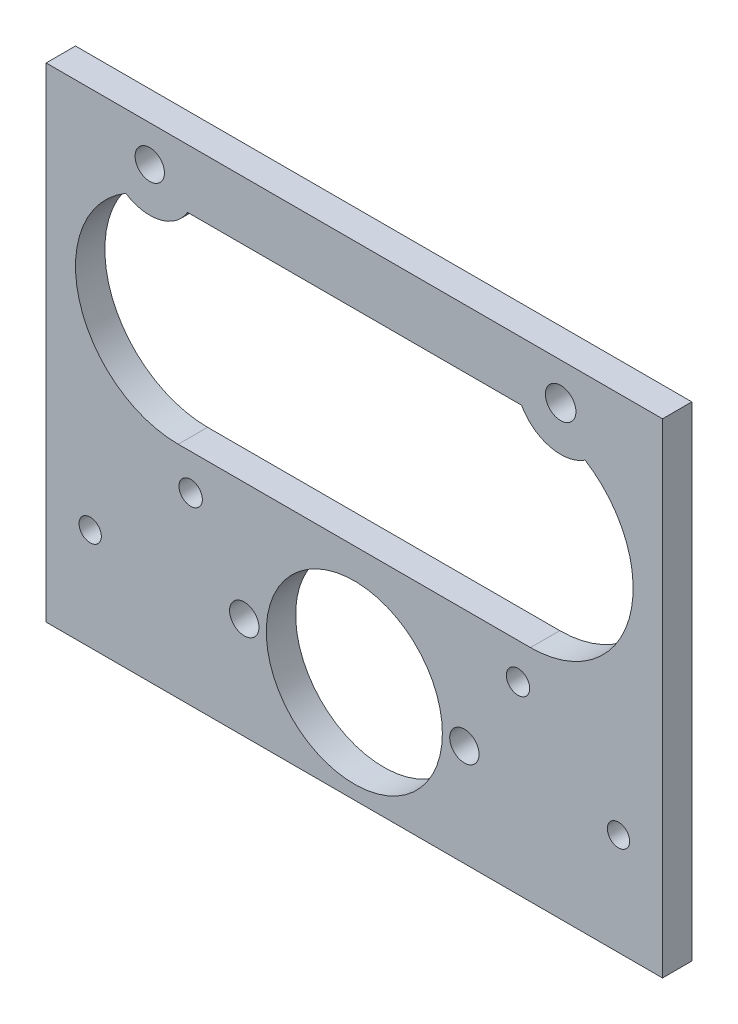
ISO-10303-21;
HEADER;
FILE_DESCRIPTION(('STEP AP214'),'2;1');
FILE_NAME('part.step','',(''),(''),'','','');
FILE_SCHEMA(('AUTOMOTIVE_DESIGN { 1 0 10303 214 1 1 1 1 }'));
ENDSEC;
DATA;
#1=APPLICATION_CONTEXT('core data for automotive mechanical design processes');
#2=APPLICATION_PROTOCOL_DEFINITION('international standard','automotive_design',2000,#1);
#3=PRODUCT_CONTEXT('',#1,'mechanical');
#4=PRODUCT('Part','Part','',(#3));
#5=PRODUCT_RELATED_PRODUCT_CATEGORY('part','',(#4));
#6=PRODUCT_DEFINITION_FORMATION('','',#4);
#7=PRODUCT_DEFINITION_CONTEXT('part definition',#1,'design');
#8=PRODUCT_DEFINITION('design','',#6,#7);
#9=PRODUCT_DEFINITION_SHAPE('','',#8);
#10=(LENGTH_UNIT() NAMED_UNIT(*) SI_UNIT(.MILLI.,.METRE.));
#11=(NAMED_UNIT(*) PLANE_ANGLE_UNIT() SI_UNIT($,.RADIAN.));
#12=(NAMED_UNIT(*) SI_UNIT($,.STERADIAN.) SOLID_ANGLE_UNIT());
#13=UNCERTAINTY_MEASURE_WITH_UNIT(LENGTH_MEASURE(1.E-05),#10,'distance_accuracy_value','');
#14=(GEOMETRIC_REPRESENTATION_CONTEXT(3) GLOBAL_UNCERTAINTY_ASSIGNED_CONTEXT((#13)) GLOBAL_UNIT_ASSIGNED_CONTEXT((#10,
#11,#12)) REPRESENTATION_CONTEXT('',''));
#15=CARTESIAN_POINT('',(0.,0.,0.));
#16=DIRECTION('',(0.,0.,1.));
#17=DIRECTION('',(1.,0.,0.));
#18=AXIS2_PLACEMENT_3D('',#15,#16,#17);
#19=CARTESIAN_POINT('',(-66.675,-22.0345,-6.35));
#20=DIRECTION('',(0.,-1.,0.));
#21=DIRECTION('',(0.,0.,-1.));
#22=AXIS2_PLACEMENT_3D('',#19,#20,#21);
#23=PLANE('',#22);
#24=DIRECTION('',(1.,0.,0.));
#25=VECTOR('',#24,1.);
#26=CARTESIAN_POINT('',(-66.675,-22.0345,0.));
#27=LINE('',#26,#25);
#28=CARTESIAN_POINT('',(-66.675,-22.0345,0.));
#29=VERTEX_POINT('',#28);
#30=CARTESIAN_POINT('',(66.675,-22.0345,0.));
#31=VERTEX_POINT('',#30);
#32=EDGE_CURVE('E175',#29,#31,#27,.T.);
#33=ORIENTED_EDGE('',*,*,#32,.F.);
#34=DIRECTION('',(0.,0.,1.));
#35=VECTOR('',#34,1.);
#36=CARTESIAN_POINT('',(-66.675,-22.0345,-6.35));
#37=LINE('',#36,#35);
#38=CARTESIAN_POINT('',(-66.675,-22.0345,-6.35));
#39=VERTEX_POINT('',#38);
#40=EDGE_CURVE('E11',#39,#29,#37,.T.);
#41=ORIENTED_EDGE('',*,*,#40,.F.);
#42=DIRECTION('',(1.,0.,0.));
#43=VECTOR('',#42,1.);
#44=CARTESIAN_POINT('',(-66.675,-22.0345,-6.35));
#45=LINE('',#44,#43);
#46=CARTESIAN_POINT('',(66.675,-22.0345,-6.35));
#47=VERTEX_POINT('',#46);
#48=EDGE_CURVE('E178',#39,#47,#45,.T.);
#49=ORIENTED_EDGE('',*,*,#48,.T.);
#50=DIRECTION('',(0.,0.,1.));
#51=VECTOR('',#50,1.);
#52=CARTESIAN_POINT('',(66.675,-22.0345,-6.35));
#53=LINE('',#52,#51);
#54=EDGE_CURVE('E35',#47,#31,#53,.T.);
#55=ORIENTED_EDGE('',*,*,#54,.T.);
#56=EDGE_LOOP('',(#33,#41,#49,#55));
#57=FACE_BOUND('',#56,.T.);
#58=ADVANCED_FACE('F32',(#57),#23,.T.);
#59=CARTESIAN_POINT('',(-66.675,82.7405,-6.35));
#60=DIRECTION('',(-1.,0.,0.));
#61=DIRECTION('',(0.,0.,1.));
#62=AXIS2_PLACEMENT_3D('',#59,#60,#61);
#63=PLANE('',#62);
#64=DIRECTION('',(0.,-1.,0.));
#65=VECTOR('',#64,1.);
#66=CARTESIAN_POINT('',(-66.675,82.7405,0.));
#67=LINE('',#66,#65);
#68=CARTESIAN_POINT('',(-66.675,82.7405,0.));
#69=VERTEX_POINT('',#68);
#70=EDGE_CURVE('E182',#69,#29,#67,.T.);
#71=ORIENTED_EDGE('',*,*,#70,.F.);
#72=DIRECTION('',(0.,0.,1.));
#73=VECTOR('',#72,1.);
#74=CARTESIAN_POINT('',(-66.675,82.7405,-6.35));
#75=LINE('',#74,#73);
#76=CARTESIAN_POINT('',(-66.675,82.7405,-6.35));
#77=VERTEX_POINT('',#76);
#78=EDGE_CURVE('E40',#77,#69,#75,.T.);
#79=ORIENTED_EDGE('',*,*,#78,.F.);
#80=DIRECTION('',(0.,-1.,0.));
#81=VECTOR('',#80,1.);
#82=CARTESIAN_POINT('',(-66.675,82.7405,-6.35));
#83=LINE('',#82,#81);
#84=EDGE_CURVE('E188',#77,#39,#83,.T.);
#85=ORIENTED_EDGE('',*,*,#84,.T.);
#86=ORIENTED_EDGE('',*,*,#40,.T.);
#87=EDGE_LOOP('',(#71,#79,#85,#86));
#88=FACE_BOUND('',#87,.T.);
#89=ADVANCED_FACE('F214',(#88),#63,.T.);
#90=CARTESIAN_POINT('',(-66.675,82.7405,-6.35));
#91=DIRECTION('',(0.,1.,0.));
#92=DIRECTION('',(0.,0.,1.));
#93=AXIS2_PLACEMENT_3D('',#90,#91,#92);
#94=PLANE('',#93);
#95=DIRECTION('',(-1.,0.,0.));
#96=VECTOR('',#95,1.);
#97=CARTESIAN_POINT('',(-66.675,82.7405,0.));
#98=LINE('',#97,#96);
#99=CARTESIAN_POINT('',(66.675,82.7405,0.));
#100=VERTEX_POINT('',#99);
#101=EDGE_CURVE('E196',#100,#69,#98,.T.);
#102=ORIENTED_EDGE('',*,*,#101,.F.);
#103=DIRECTION('',(0.,0.,1.));
#104=VECTOR('',#103,1.);
#105=CARTESIAN_POINT('',(66.675,82.7405,-6.35));
#106=LINE('',#105,#104);
#107=CARTESIAN_POINT('',(66.675,82.7405,-6.35));
#108=VERTEX_POINT('',#107);
#109=EDGE_CURVE('E201',#108,#100,#106,.T.);
#110=ORIENTED_EDGE('',*,*,#109,.F.);
#111=DIRECTION('',(-1.,0.,0.));
#112=VECTOR('',#111,1.);
#113=CARTESIAN_POINT('',(-66.675,82.7405,-6.35));
#114=LINE('',#113,#112);
#115=EDGE_CURVE('E185',#108,#77,#114,.T.);
#116=ORIENTED_EDGE('',*,*,#115,.T.);
#117=ORIENTED_EDGE('',*,*,#78,.T.);
#118=EDGE_LOOP('',(#102,#110,#116,#117));
#119=FACE_BOUND('',#118,.T.);
#120=ADVANCED_FACE('F219',(#119),#94,.T.);
#121=CARTESIAN_POINT('',(66.675,-22.0345,-6.35));
#122=DIRECTION('',(1.,0.,0.));
#123=DIRECTION('',(0.,0.,-1.));
#124=AXIS2_PLACEMENT_3D('',#121,#122,#123);
#125=PLANE('',#124);
#126=DIRECTION('',(0.,1.,0.));
#127=VECTOR('',#126,1.);
#128=CARTESIAN_POINT('',(66.675,-22.0345,0.));
#129=LINE('',#128,#127);
#130=EDGE_CURVE('E193',#31,#100,#129,.T.);
#131=ORIENTED_EDGE('',*,*,#130,.F.);
#132=ORIENTED_EDGE('',*,*,#54,.F.);
#133=DIRECTION('',(0.,1.,0.));
#134=VECTOR('',#133,1.);
#135=CARTESIAN_POINT('',(66.675,-22.0345,-6.35));
#136=LINE('',#135,#134);
#137=EDGE_CURVE('E181',#47,#108,#136,.T.);
#138=ORIENTED_EDGE('',*,*,#137,.T.);
#139=ORIENTED_EDGE('',*,*,#109,.T.);
#140=EDGE_LOOP('',(#131,#132,#138,#139));
#141=FACE_BOUND('',#140,.T.);
#142=ADVANCED_FACE('F209',(#141),#125,.T.);
#143=CARTESIAN_POINT('',(0.,0.,-6.35));
#144=DIRECTION('',(0.,0.,1.));
#145=DIRECTION('',(1.,0.,0.));
#146=AXIS2_PLACEMENT_3D('',#143,#144,#145);
#147=PLANE('',#146);
#148=CARTESIAN_POINT('',(57.1499999999999,-1.07552855510562E-13,-6.35));
#149=DIRECTION('',(0.,0.,1.));
#150=DIRECTION('',(1.,0.,0.));
#151=AXIS2_PLACEMENT_3D('',#148,#149,#150);
#152=CIRCLE('',#151,2.41299999999997);
#153=CARTESIAN_POINT('',(59.5629999999998,-1.07552855510562E-13,-6.35));
#154=VERTEX_POINT('',#153);
#155=EDGE_CURVE('E414',#154,#154,#152,.T.);
#156=ORIENTED_EDGE('',*,*,#155,.T.);
#157=EDGE_LOOP('',(#156));
#158=FACE_BOUND('',#157,.T.);
#159=CARTESIAN_POINT('',(35.4115067199124,17.8307999999999,-6.35));
#160=DIRECTION('',(0.,0.,1.));
#161=DIRECTION('',(1.,0.,0.));
#162=AXIS2_PLACEMENT_3D('',#159,#160,#161);
#163=CIRCLE('',#162,2.52729999999989);
#164=CARTESIAN_POINT('',(37.9388067199123,17.8307999999999,-6.35));
#165=VERTEX_POINT('',#164);
#166=EDGE_CURVE('E422',#165,#165,#163,.T.);
#167=ORIENTED_EDGE('',*,*,#166,.T.);
#168=EDGE_LOOP('',(#167));
#169=FACE_BOUND('',#168,.T.);
#170=CARTESIAN_POINT('',(23.8125,0.,-6.35));
#171=DIRECTION('',(0.,0.,1.));
#172=DIRECTION('',(1.,0.,0.));
#173=AXIS2_PLACEMENT_3D('',#170,#171,#172);
#174=CIRCLE('',#173,3.17499999999995);
#175=CARTESIAN_POINT('',(26.9874999999999,0.,-6.35));
#176=VERTEX_POINT('',#175);
#177=EDGE_CURVE('E428',#176,#176,#174,.T.);
#178=ORIENTED_EDGE('',*,*,#177,.T.);
#179=EDGE_LOOP('',(#178));
#180=FACE_BOUND('',#179,.T.);
#181=CARTESIAN_POINT('',(0.,0.,-6.35));
#182=DIRECTION('',(0.,0.,1.));
#183=DIRECTION('',(1.,0.,0.));
#184=AXIS2_PLACEMENT_3D('',#181,#182,#183);
#185=CIRCLE('',#184,19.05);
#186=CARTESIAN_POINT('',(19.0499999999999,0.,-6.35));
#187=VERTEX_POINT('',#186);
#188=EDGE_CURVE('E434',#187,#187,#185,.T.);
#189=ORIENTED_EDGE('',*,*,#188,.T.);
#190=EDGE_LOOP('',(#189));
#191=FACE_BOUND('',#190,.T.);
#192=CARTESIAN_POINT('',(-23.8125,0.,-6.35));
#193=DIRECTION('',(0.,0.,1.));
#194=DIRECTION('',(1.,0.,0.));
#195=AXIS2_PLACEMENT_3D('',#192,#193,#194);
#196=CIRCLE('',#195,3.17499999999995);
#197=CARTESIAN_POINT('',(-20.6375000000001,0.,-6.35));
#198=VERTEX_POINT('',#197);
#199=EDGE_CURVE('E440',#198,#198,#196,.T.);
#200=ORIENTED_EDGE('',*,*,#199,.T.);
#201=EDGE_LOOP('',(#200));
#202=FACE_BOUND('',#201,.T.);
#203=CARTESIAN_POINT('',(-35.4115067199124,17.8308,-6.35));
#204=DIRECTION('',(0.,0.,1.));
#205=DIRECTION('',(1.,0.,0.));
#206=AXIS2_PLACEMENT_3D('',#203,#204,#205);
#207=CIRCLE('',#206,2.52729999999993);
#208=CARTESIAN_POINT('',(-32.8842067199124,17.8308,-6.35));
#209=VERTEX_POINT('',#208);
#210=EDGE_CURVE('E446',#209,#209,#207,.T.);
#211=ORIENTED_EDGE('',*,*,#210,.T.);
#212=EDGE_LOOP('',(#211));
#213=FACE_BOUND('',#212,.T.);
#214=CARTESIAN_POINT('',(-57.1500000000001,0.,-6.35));
#215=DIRECTION('',(0.,0.,1.));
#216=DIRECTION('',(1.,0.,0.));
#217=AXIS2_PLACEMENT_3D('',#214,#215,#216);
#218=CIRCLE('',#217,2.41299999999997);
#219=CARTESIAN_POINT('',(-54.7370000000001,0.,-6.35));
#220=VERTEX_POINT('',#219);
#221=EDGE_CURVE('E146',#220,#220,#218,.T.);
#222=ORIENTED_EDGE('',*,*,#221,.T.);
#223=EDGE_LOOP('',(#222));
#224=FACE_BOUND('',#223,.T.);
#225=CARTESIAN_POINT('',(-44.2581816086823,74.9211107919667,-6.35));
#226=DIRECTION('',(0.,0.,-1.));
#227=DIRECTION('',(1.,0.,0.));
#228=AXIS2_PLACEMENT_3D('',#225,#226,#227);
#229=CIRCLE('',#228,9.525);
#230=CARTESIAN_POINT('',(-36.0786178490837,70.0405,-6.35));
#231=VERTEX_POINT('',#230);
#232=CARTESIAN_POINT('',(-49.4406415663801,66.9293817057889,-6.35));
#233=VERTEX_POINT('',#232);
#234=EDGE_CURVE('E117',#231,#233,#229,.T.);
#235=ORIENTED_EDGE('',*,*,#234,.T.);
#236=CARTESIAN_POINT('',(-38.1,47.8155,-6.35));
#237=DIRECTION('',(0.,0.,1.));
#238=DIRECTION('',(1.,0.,0.));
#239=AXIS2_PLACEMENT_3D('',#236,#237,#238);
#240=CIRCLE('',#239,22.225);
#241=CARTESIAN_POINT('',(-38.1,25.5905,-6.35));
#242=VERTEX_POINT('',#241);
#243=EDGE_CURVE('E111',#233,#242,#240,.T.);
#244=ORIENTED_EDGE('',*,*,#243,.T.);
#245=DIRECTION('',(1.,0.,0.));
#246=VECTOR('',#245,1.);
#247=CARTESIAN_POINT('',(-38.1,25.5905,-6.35));
#248=LINE('',#247,#246);
#249=CARTESIAN_POINT('',(38.1,25.5905,-6.35));
#250=VERTEX_POINT('',#249);
#251=EDGE_CURVE('E120',#242,#250,#248,.T.);
#252=ORIENTED_EDGE('',*,*,#251,.T.);
#253=CARTESIAN_POINT('',(38.1,47.8155,-6.35));
#254=DIRECTION('',(0.,0.,1.));
#255=DIRECTION('',(1.,0.,0.));
#256=AXIS2_PLACEMENT_3D('',#253,#254,#255);
#257=CIRCLE('',#256,22.225);
#258=CARTESIAN_POINT('',(49.9388189514144,66.624885711278,-6.35));
#259=VERTEX_POINT('',#258);
#260=EDGE_CURVE('E48',#250,#259,#257,.T.);
#261=ORIENTED_EDGE('',*,*,#260,.T.);
#262=CARTESIAN_POINT('',(44.641526579993,74.6933302659416,-6.35));
#263=DIRECTION('',(0.,0.,-1.));
#264=DIRECTION('',(1.,0.,0.));
#265=AXIS2_PLACEMENT_3D('',#262,#263,#264);
#266=CIRCLE('',#265,9.65199999999999);
#267=CARTESIAN_POINT('',(36.18503354113,70.0405,-6.35));
#268=VERTEX_POINT('',#267);
#269=EDGE_CURVE('E138',#259,#268,#266,.T.);
#270=ORIENTED_EDGE('',*,*,#269,.T.);
#271=DIRECTION('',(-1.,0.,0.));
#272=VECTOR('',#271,1.);
#273=CARTESIAN_POINT('',(-36.0786178490837,70.0405,-6.35));
#274=LINE('',#273,#272);
#275=EDGE_CURVE('E141',#268,#231,#274,.T.);
#276=ORIENTED_EDGE('',*,*,#275,.T.);
#277=EDGE_LOOP('',(#235,#244,#252,#261,#270,#276));
#278=FACE_BOUND('',#277,.T.);
#279=CARTESIAN_POINT('',(-44.2581816086823,74.9211107919667,-6.35));
#280=DIRECTION('',(0.,0.,1.));
#281=DIRECTION('',(1.,0.,0.));
#282=AXIS2_PLACEMENT_3D('',#279,#280,#281);
#283=CIRCLE('',#282,3.175);
#284=CARTESIAN_POINT('',(-41.0831816086823,74.9211107919667,-6.35));
#285=VERTEX_POINT('',#284);
#286=EDGE_CURVE('E166',#285,#285,#283,.T.);
#287=ORIENTED_EDGE('',*,*,#286,.T.);
#288=EDGE_LOOP('',(#287));
#289=FACE_BOUND('',#288,.T.);
#290=CARTESIAN_POINT('',(44.641526579993,74.6933302659416,-6.35));
#291=DIRECTION('',(0.,0.,1.));
#292=DIRECTION('',(1.,0.,0.));
#293=AXIS2_PLACEMENT_3D('',#290,#291,#292);
#294=CIRCLE('',#293,3.30199999999999);
#295=CARTESIAN_POINT('',(47.943526579993,74.6933302659416,-6.35));
#296=VERTEX_POINT('',#295);
#297=EDGE_CURVE('E172',#296,#296,#294,.T.);
#298=ORIENTED_EDGE('',*,*,#297,.T.);
#299=EDGE_LOOP('',(#298));
#300=FACE_BOUND('',#299,.T.);
#301=ORIENTED_EDGE('',*,*,#48,.F.);
#302=ORIENTED_EDGE('',*,*,#84,.F.);
#303=ORIENTED_EDGE('',*,*,#115,.F.);
#304=ORIENTED_EDGE('',*,*,#137,.F.);
#305=EDGE_LOOP('',(#301,#302,#303,#304));
#306=FACE_BOUND('',#305,.T.);
#307=ADVANCED_FACE('F124',(#158,#169,#180,#191,#202,#213,#224,#278,#289,#300,#306),#147,.F.);
#308=CARTESIAN_POINT('',(0.,0.,0.));
#309=DIRECTION('',(0.,0.,1.));
#310=DIRECTION('',(1.,0.,0.));
#311=AXIS2_PLACEMENT_3D('',#308,#309,#310);
#312=PLANE('',#311);
#313=CARTESIAN_POINT('',(57.1499999999999,-1.07552855510562E-13,0.));
#314=DIRECTION('',(0.,0.,1.));
#315=DIRECTION('',(1.,0.,0.));
#316=AXIS2_PLACEMENT_3D('',#313,#314,#315);
#317=CIRCLE('',#316,2.41299999999997);
#318=CARTESIAN_POINT('',(59.5629999999998,-1.07552855510562E-13,0.));
#319=VERTEX_POINT('',#318);
#320=EDGE_CURVE('E417',#319,#319,#317,.T.);
#321=ORIENTED_EDGE('',*,*,#320,.F.);
#322=EDGE_LOOP('',(#321));
#323=FACE_BOUND('',#322,.T.);
#324=CARTESIAN_POINT('',(35.4115067199124,17.8307999999999,0.));
#325=DIRECTION('',(0.,0.,1.));
#326=DIRECTION('',(1.,0.,0.));
#327=AXIS2_PLACEMENT_3D('',#324,#325,#326);
#328=CIRCLE('',#327,2.52729999999989);
#329=CARTESIAN_POINT('',(37.9388067199123,17.8307999999999,0.));
#330=VERTEX_POINT('',#329);
#331=EDGE_CURVE('E419',#330,#330,#328,.T.);
#332=ORIENTED_EDGE('',*,*,#331,.F.);
#333=EDGE_LOOP('',(#332));
#334=FACE_BOUND('',#333,.T.);
#335=CARTESIAN_POINT('',(23.8125,0.,0.));
#336=DIRECTION('',(0.,0.,1.));
#337=DIRECTION('',(1.,0.,0.));
#338=AXIS2_PLACEMENT_3D('',#335,#336,#337);
#339=CIRCLE('',#338,3.17499999999995);
#340=CARTESIAN_POINT('',(26.9874999999999,0.,0.));
#341=VERTEX_POINT('',#340);
#342=EDGE_CURVE('E425',#341,#341,#339,.T.);
#343=ORIENTED_EDGE('',*,*,#342,.F.);
#344=EDGE_LOOP('',(#343));
#345=FACE_BOUND('',#344,.T.);
#346=CARTESIAN_POINT('',(0.,0.,0.));
#347=DIRECTION('',(0.,0.,1.));
#348=DIRECTION('',(1.,0.,0.));
#349=AXIS2_PLACEMENT_3D('',#346,#347,#348);
#350=CIRCLE('',#349,19.05);
#351=CARTESIAN_POINT('',(19.0499999999999,0.,0.));
#352=VERTEX_POINT('',#351);
#353=EDGE_CURVE('E431',#352,#352,#350,.T.);
#354=ORIENTED_EDGE('',*,*,#353,.F.);
#355=EDGE_LOOP('',(#354));
#356=FACE_BOUND('',#355,.T.);
#357=CARTESIAN_POINT('',(-23.8125,0.,0.));
#358=DIRECTION('',(0.,0.,1.));
#359=DIRECTION('',(1.,0.,0.));
#360=AXIS2_PLACEMENT_3D('',#357,#358,#359);
#361=CIRCLE('',#360,3.17499999999995);
#362=CARTESIAN_POINT('',(-20.6375000000001,0.,0.));
#363=VERTEX_POINT('',#362);
#364=EDGE_CURVE('E437',#363,#363,#361,.T.);
#365=ORIENTED_EDGE('',*,*,#364,.F.);
#366=EDGE_LOOP('',(#365));
#367=FACE_BOUND('',#366,.T.);
#368=CARTESIAN_POINT('',(-35.4115067199124,17.8308,0.));
#369=DIRECTION('',(0.,0.,1.));
#370=DIRECTION('',(1.,0.,0.));
#371=AXIS2_PLACEMENT_3D('',#368,#369,#370);
#372=CIRCLE('',#371,2.52729999999993);
#373=CARTESIAN_POINT('',(-32.8842067199124,17.8308,0.));
#374=VERTEX_POINT('',#373);
#375=EDGE_CURVE('E443',#374,#374,#372,.T.);
#376=ORIENTED_EDGE('',*,*,#375,.F.);
#377=EDGE_LOOP('',(#376));
#378=FACE_BOUND('',#377,.T.);
#379=CARTESIAN_POINT('',(-57.1500000000001,0.,0.));
#380=DIRECTION('',(0.,0.,1.));
#381=DIRECTION('',(1.,0.,0.));
#382=AXIS2_PLACEMENT_3D('',#379,#380,#381);
#383=CIRCLE('',#382,2.41299999999997);
#384=CARTESIAN_POINT('',(-54.7370000000001,0.,0.));
#385=VERTEX_POINT('',#384);
#386=EDGE_CURVE('E134',#385,#385,#383,.T.);
#387=ORIENTED_EDGE('',*,*,#386,.F.);
#388=EDGE_LOOP('',(#387));
#389=FACE_BOUND('',#388,.T.);
#390=CARTESIAN_POINT('',(-38.1,47.8155,0.));
#391=DIRECTION('',(0.,0.,1.));
#392=DIRECTION('',(1.,0.,0.));
#393=AXIS2_PLACEMENT_3D('',#390,#391,#392);
#394=CIRCLE('',#393,22.225);
#395=CARTESIAN_POINT('',(-49.4406415663801,66.9293817057889,0.));
#396=VERTEX_POINT('',#395);
#397=CARTESIAN_POINT('',(-38.1,25.5905,0.));
#398=VERTEX_POINT('',#397);
#399=EDGE_CURVE('E56',#396,#398,#394,.T.);
#400=ORIENTED_EDGE('',*,*,#399,.F.);
#401=CARTESIAN_POINT('',(-44.2581816086823,74.9211107919667,0.));
#402=DIRECTION('',(0.,0.,-1.));
#403=DIRECTION('',(1.,0.,0.));
#404=AXIS2_PLACEMENT_3D('',#401,#402,#403);
#405=CIRCLE('',#404,9.525);
#406=CARTESIAN_POINT('',(-36.0786178490837,70.0405,0.));
#407=VERTEX_POINT('',#406);
#408=EDGE_CURVE('E128',#407,#396,#405,.T.);
#409=ORIENTED_EDGE('',*,*,#408,.F.);
#410=DIRECTION('',(-1.,0.,0.));
#411=VECTOR('',#410,1.);
#412=CARTESIAN_POINT('',(-36.0786178490837,70.0405,0.));
#413=LINE('',#412,#411);
#414=CARTESIAN_POINT('',(36.18503354113,70.0405,0.));
#415=VERTEX_POINT('',#414);
#416=EDGE_CURVE('E131',#415,#407,#413,.T.);
#417=ORIENTED_EDGE('',*,*,#416,.F.);
#418=CARTESIAN_POINT('',(44.641526579993,74.6933302659416,0.));
#419=DIRECTION('',(0.,0.,-1.));
#420=DIRECTION('',(1.,0.,0.));
#421=AXIS2_PLACEMENT_3D('',#418,#419,#420);
#422=CIRCLE('',#421,9.65199999999999);
#423=CARTESIAN_POINT('',(49.9388189514144,66.624885711278,0.));
#424=VERTEX_POINT('',#423);
#425=EDGE_CURVE('E151',#424,#415,#422,.T.);
#426=ORIENTED_EDGE('',*,*,#425,.F.);
#427=CARTESIAN_POINT('',(38.1,47.8155,0.));
#428=DIRECTION('',(0.,0.,1.));
#429=DIRECTION('',(1.,0.,0.));
#430=AXIS2_PLACEMENT_3D('',#427,#428,#429);
#431=CIRCLE('',#430,22.225);
#432=CARTESIAN_POINT('',(38.1,25.5905,0.));
#433=VERTEX_POINT('',#432);
#434=EDGE_CURVE('E148',#433,#424,#431,.T.);
#435=ORIENTED_EDGE('',*,*,#434,.F.);
#436=DIRECTION('',(1.,0.,0.));
#437=VECTOR('',#436,1.);
#438=CARTESIAN_POINT('',(-38.1,25.5905,0.));
#439=LINE('',#438,#437);
#440=EDGE_CURVE('E145',#398,#433,#439,.T.);
#441=ORIENTED_EDGE('',*,*,#440,.F.);
#442=EDGE_LOOP('',(#400,#409,#417,#426,#435,#441));
#443=FACE_BOUND('',#442,.T.);
#444=CARTESIAN_POINT('',(-44.2581816086823,74.9211107919667,0.));
#445=DIRECTION('',(0.,0.,1.));
#446=DIRECTION('',(1.,0.,0.));
#447=AXIS2_PLACEMENT_3D('',#444,#445,#446);
#448=CIRCLE('',#447,3.175);
#449=CARTESIAN_POINT('',(-41.0831816086823,74.9211107919667,0.));
#450=VERTEX_POINT('',#449);
#451=EDGE_CURVE('E158',#450,#450,#448,.T.);
#452=ORIENTED_EDGE('',*,*,#451,.F.);
#453=EDGE_LOOP('',(#452));
#454=FACE_BOUND('',#453,.T.);
#455=CARTESIAN_POINT('',(44.641526579993,74.6933302659416,0.));
#456=DIRECTION('',(0.,0.,1.));
#457=DIRECTION('',(1.,0.,0.));
#458=AXIS2_PLACEMENT_3D('',#455,#456,#457);
#459=CIRCLE('',#458,3.30199999999999);
#460=CARTESIAN_POINT('',(47.943526579993,74.6933302659416,0.));
#461=VERTEX_POINT('',#460);
#462=EDGE_CURVE('E169',#461,#461,#459,.T.);
#463=ORIENTED_EDGE('',*,*,#462,.F.);
#464=EDGE_LOOP('',(#463));
#465=FACE_BOUND('',#464,.T.);
#466=ORIENTED_EDGE('',*,*,#32,.T.);
#467=ORIENTED_EDGE('',*,*,#130,.T.);
#468=ORIENTED_EDGE('',*,*,#101,.T.);
#469=ORIENTED_EDGE('',*,*,#70,.T.);
#470=EDGE_LOOP('',(#466,#467,#468,#469));
#471=FACE_BOUND('',#470,.T.);
#472=ADVANCED_FACE('F211',(#323,#334,#345,#356,#367,#378,#389,#443,#454,#465,#471),#312,.T.);
#473=CARTESIAN_POINT('',(44.641526579993,74.6933302659416,-6.35));
#474=DIRECTION('',(0.,0.,1.));
#475=DIRECTION('',(1.,0.,0.));
#476=AXIS2_PLACEMENT_3D('',#473,#474,#475);
#477=CYLINDRICAL_SURFACE('',#476,3.30199999999999);
#478=ORIENTED_EDGE('',*,*,#297,.F.);
#479=EDGE_LOOP('',(#478));
#480=FACE_BOUND('',#479,.T.);
#481=ORIENTED_EDGE('',*,*,#462,.T.);
#482=EDGE_LOOP('',(#481));
#483=FACE_BOUND('',#482,.T.);
#484=ADVANCED_FACE('F262',(#480,#483),#477,.F.);
#485=CARTESIAN_POINT('',(-44.2581816086823,74.9211107919667,-6.35));
#486=DIRECTION('',(0.,0.,1.));
#487=DIRECTION('',(1.,0.,0.));
#488=AXIS2_PLACEMENT_3D('',#485,#486,#487);
#489=CYLINDRICAL_SURFACE('',#488,3.175);
#490=ORIENTED_EDGE('',*,*,#286,.F.);
#491=EDGE_LOOP('',(#490));
#492=FACE_BOUND('',#491,.T.);
#493=ORIENTED_EDGE('',*,*,#451,.T.);
#494=EDGE_LOOP('',(#493));
#495=FACE_BOUND('',#494,.T.);
#496=ADVANCED_FACE('F272',(#492,#495),#489,.F.);
#497=CARTESIAN_POINT('',(-38.1,47.8155,-6.35));
#498=DIRECTION('',(0.,0.,1.));
#499=DIRECTION('',(1.,0.,0.));
#500=AXIS2_PLACEMENT_3D('',#497,#498,#499);
#501=CYLINDRICAL_SURFACE('',#500,22.225);
#502=ORIENTED_EDGE('',*,*,#399,.T.);
#503=DIRECTION('',(0.,0.,1.));
#504=VECTOR('',#503,1.);
#505=CARTESIAN_POINT('',(-38.1,25.5905,-6.35));
#506=LINE('',#505,#504);
#507=EDGE_CURVE('E107',#242,#398,#506,.T.);
#508=ORIENTED_EDGE('',*,*,#507,.F.);
#509=ORIENTED_EDGE('',*,*,#243,.F.);
#510=DIRECTION('',(0.,0.,1.));
#511=VECTOR('',#510,1.);
#512=CARTESIAN_POINT('',(-49.4406415663801,66.9293817057889,-6.35));
#513=LINE('',#512,#511);
#514=EDGE_CURVE('E156',#233,#396,#513,.T.);
#515=ORIENTED_EDGE('',*,*,#514,.T.);
#516=EDGE_LOOP('',(#502,#508,#509,#515));
#517=FACE_BOUND('',#516,.T.);
#518=ADVANCED_FACE('F109',(#517),#501,.F.);
#519=CARTESIAN_POINT('',(-44.2581816086823,74.9211107919667,-6.35));
#520=DIRECTION('',(0.,0.,1.));
#521=DIRECTION('',(1.,0.,0.));
#522=AXIS2_PLACEMENT_3D('',#519,#520,#521);
#523=CYLINDRICAL_SURFACE('',#522,9.525);
#524=ORIENTED_EDGE('',*,*,#408,.T.);
#525=ORIENTED_EDGE('',*,*,#514,.F.);
#526=ORIENTED_EDGE('',*,*,#234,.F.);
#527=DIRECTION('',(0.,0.,1.));
#528=VECTOR('',#527,1.);
#529=CARTESIAN_POINT('',(-36.0786178490837,70.0405,-6.35));
#530=LINE('',#529,#528);
#531=EDGE_CURVE('E159',#231,#407,#530,.T.);
#532=ORIENTED_EDGE('',*,*,#531,.T.);
#533=EDGE_LOOP('',(#524,#525,#526,#532));
#534=FACE_BOUND('',#533,.T.);
#535=ADVANCED_FACE('F291',(#534),#523,.T.);
#536=CARTESIAN_POINT('',(-36.0786178490837,70.0405,-6.35));
#537=DIRECTION('',(0.,1.,0.));
#538=DIRECTION('',(0.,0.,1.));
#539=AXIS2_PLACEMENT_3D('',#536,#537,#538);
#540=PLANE('',#539);
#541=ORIENTED_EDGE('',*,*,#416,.T.);
#542=ORIENTED_EDGE('',*,*,#531,.F.);
#543=ORIENTED_EDGE('',*,*,#275,.F.);
#544=DIRECTION('',(0.,0.,1.));
#545=VECTOR('',#544,1.);
#546=CARTESIAN_POINT('',(36.18503354113,70.0405,-6.35));
#547=LINE('',#546,#545);
#548=EDGE_CURVE('E161',#268,#415,#547,.T.);
#549=ORIENTED_EDGE('',*,*,#548,.T.);
#550=EDGE_LOOP('',(#541,#542,#543,#549));
#551=FACE_BOUND('',#550,.T.);
#552=ADVANCED_FACE('F300',(#551),#540,.F.);
#553=CARTESIAN_POINT('',(44.641526579993,74.6933302659416,-6.35));
#554=DIRECTION('',(0.,0.,1.));
#555=DIRECTION('',(1.,0.,0.));
#556=AXIS2_PLACEMENT_3D('',#553,#554,#555);
#557=CYLINDRICAL_SURFACE('',#556,9.65199999999999);
#558=ORIENTED_EDGE('',*,*,#425,.T.);
#559=ORIENTED_EDGE('',*,*,#548,.F.);
#560=ORIENTED_EDGE('',*,*,#269,.F.);
#561=DIRECTION('',(0.,0.,1.));
#562=VECTOR('',#561,1.);
#563=CARTESIAN_POINT('',(49.9388189514144,66.624885711278,-6.35));
#564=LINE('',#563,#562);
#565=EDGE_CURVE('E163',#259,#424,#564,.T.);
#566=ORIENTED_EDGE('',*,*,#565,.T.);
#567=EDGE_LOOP('',(#558,#559,#560,#566));
#568=FACE_BOUND('',#567,.T.);
#569=ADVANCED_FACE('F310',(#568),#557,.T.);
#570=CARTESIAN_POINT('',(38.1,47.8155,-6.35));
#571=DIRECTION('',(0.,0.,1.));
#572=DIRECTION('',(1.,0.,0.));
#573=AXIS2_PLACEMENT_3D('',#570,#571,#572);
#574=CYLINDRICAL_SURFACE('',#573,22.225);
#575=ORIENTED_EDGE('',*,*,#434,.T.);
#576=ORIENTED_EDGE('',*,*,#565,.F.);
#577=ORIENTED_EDGE('',*,*,#260,.F.);
#578=DIRECTION('',(0.,0.,1.));
#579=VECTOR('',#578,1.);
#580=CARTESIAN_POINT('',(38.1,25.5905,-6.35));
#581=LINE('',#580,#579);
#582=EDGE_CURVE('E116',#250,#433,#581,.T.);
#583=ORIENTED_EDGE('',*,*,#582,.T.);
#584=EDGE_LOOP('',(#575,#576,#577,#583));
#585=FACE_BOUND('',#584,.T.);
#586=ADVANCED_FACE('F320',(#585),#574,.F.);
#587=CARTESIAN_POINT('',(-38.1,25.5905,-6.35));
#588=DIRECTION('',(0.,-1.,0.));
#589=DIRECTION('',(0.,0.,-1.));
#590=AXIS2_PLACEMENT_3D('',#587,#588,#589);
#591=PLANE('',#590);
#592=ORIENTED_EDGE('',*,*,#440,.T.);
#593=ORIENTED_EDGE('',*,*,#582,.F.);
#594=ORIENTED_EDGE('',*,*,#251,.F.);
#595=ORIENTED_EDGE('',*,*,#507,.T.);
#596=EDGE_LOOP('',(#592,#593,#594,#595));
#597=FACE_BOUND('',#596,.T.);
#598=ADVANCED_FACE('F121',(#597),#591,.F.);
#599=CARTESIAN_POINT('',(-57.1500000000001,0.,-6.35));
#600=DIRECTION('',(0.,0.,1.));
#601=DIRECTION('',(1.,0.,0.));
#602=AXIS2_PLACEMENT_3D('',#599,#600,#601);
#603=CYLINDRICAL_SURFACE('',#602,2.41299999999997);
#604=ORIENTED_EDGE('',*,*,#221,.F.);
#605=EDGE_LOOP('',(#604));
#606=FACE_BOUND('',#605,.T.);
#607=ORIENTED_EDGE('',*,*,#386,.T.);
#608=EDGE_LOOP('',(#607));
#609=FACE_BOUND('',#608,.T.);
#610=ADVANCED_FACE('F338',(#606,#609),#603,.F.);
#611=CARTESIAN_POINT('',(-35.4115067199124,17.8308,-6.35));
#612=DIRECTION('',(0.,0.,1.));
#613=DIRECTION('',(1.,0.,0.));
#614=AXIS2_PLACEMENT_3D('',#611,#612,#613);
#615=CYLINDRICAL_SURFACE('',#614,2.52729999999993);
#616=ORIENTED_EDGE('',*,*,#210,.F.);
#617=EDGE_LOOP('',(#616));
#618=FACE_BOUND('',#617,.T.);
#619=ORIENTED_EDGE('',*,*,#375,.T.);
#620=EDGE_LOOP('',(#619));
#621=FACE_BOUND('',#620,.T.);
#622=ADVANCED_FACE('F347',(#618,#621),#615,.F.);
#623=CARTESIAN_POINT('',(-23.8125,0.,-6.35));
#624=DIRECTION('',(0.,0.,1.));
#625=DIRECTION('',(1.,0.,0.));
#626=AXIS2_PLACEMENT_3D('',#623,#624,#625);
#627=CYLINDRICAL_SURFACE('',#626,3.17499999999995);
#628=ORIENTED_EDGE('',*,*,#199,.F.);
#629=EDGE_LOOP('',(#628));
#630=FACE_BOUND('',#629,.T.);
#631=ORIENTED_EDGE('',*,*,#364,.T.);
#632=EDGE_LOOP('',(#631));
#633=FACE_BOUND('',#632,.T.);
#634=ADVANCED_FACE('F357',(#630,#633),#627,.F.);
#635=CARTESIAN_POINT('',(0.,0.,-6.35));
#636=DIRECTION('',(0.,0.,1.));
#637=DIRECTION('',(1.,0.,0.));
#638=AXIS2_PLACEMENT_3D('',#635,#636,#637);
#639=CYLINDRICAL_SURFACE('',#638,19.05);
#640=ORIENTED_EDGE('',*,*,#188,.F.);
#641=EDGE_LOOP('',(#640));
#642=FACE_BOUND('',#641,.T.);
#643=ORIENTED_EDGE('',*,*,#353,.T.);
#644=EDGE_LOOP('',(#643));
#645=FACE_BOUND('',#644,.T.);
#646=ADVANCED_FACE('F367',(#642,#645),#639,.F.);
#647=CARTESIAN_POINT('',(23.8125,0.,-6.35));
#648=DIRECTION('',(0.,0.,1.));
#649=DIRECTION('',(1.,0.,0.));
#650=AXIS2_PLACEMENT_3D('',#647,#648,#649);
#651=CYLINDRICAL_SURFACE('',#650,3.17499999999995);
#652=ORIENTED_EDGE('',*,*,#177,.F.);
#653=EDGE_LOOP('',(#652));
#654=FACE_BOUND('',#653,.T.);
#655=ORIENTED_EDGE('',*,*,#342,.T.);
#656=EDGE_LOOP('',(#655));
#657=FACE_BOUND('',#656,.T.);
#658=ADVANCED_FACE('F377',(#654,#657),#651,.F.);
#659=CARTESIAN_POINT('',(35.4115067199124,17.8307999999999,-6.35));
#660=DIRECTION('',(0.,0.,1.));
#661=DIRECTION('',(1.,0.,0.));
#662=AXIS2_PLACEMENT_3D('',#659,#660,#661);
#663=CYLINDRICAL_SURFACE('',#662,2.52729999999989);
#664=ORIENTED_EDGE('',*,*,#166,.F.);
#665=EDGE_LOOP('',(#664));
#666=FACE_BOUND('',#665,.T.);
#667=ORIENTED_EDGE('',*,*,#331,.T.);
#668=EDGE_LOOP('',(#667));
#669=FACE_BOUND('',#668,.T.);
#670=ADVANCED_FACE('F387',(#666,#669),#663,.F.);
#671=CARTESIAN_POINT('',(57.1499999999999,-1.07552855510562E-13,-6.35));
#672=DIRECTION('',(0.,0.,1.));
#673=DIRECTION('',(1.,0.,0.));
#674=AXIS2_PLACEMENT_3D('',#671,#672,#673);
#675=CYLINDRICAL_SURFACE('',#674,2.41299999999997);
#676=ORIENTED_EDGE('',*,*,#155,.F.);
#677=EDGE_LOOP('',(#676));
#678=FACE_BOUND('',#677,.T.);
#679=ORIENTED_EDGE('',*,*,#320,.T.);
#680=EDGE_LOOP('',(#679));
#681=FACE_BOUND('',#680,.T.);
#682=ADVANCED_FACE('F397',(#678,#681),#675,.F.);
#683=CLOSED_SHELL('',(#58,#89,#120,#142,#307,#472,#484,#496,#518,#535,#552,#569,#586,#598,#610,
#622,#634,#646,#658,#670,#682));
#684=MANIFOLD_SOLID_BREP('B2',#683);
#685=ADVANCED_BREP_SHAPE_REPRESENTATION('',(#18,#684),#14);
#686=SHAPE_DEFINITION_REPRESENTATION(#9,#685);
ENDSEC;
END-ISO-10303-21;
